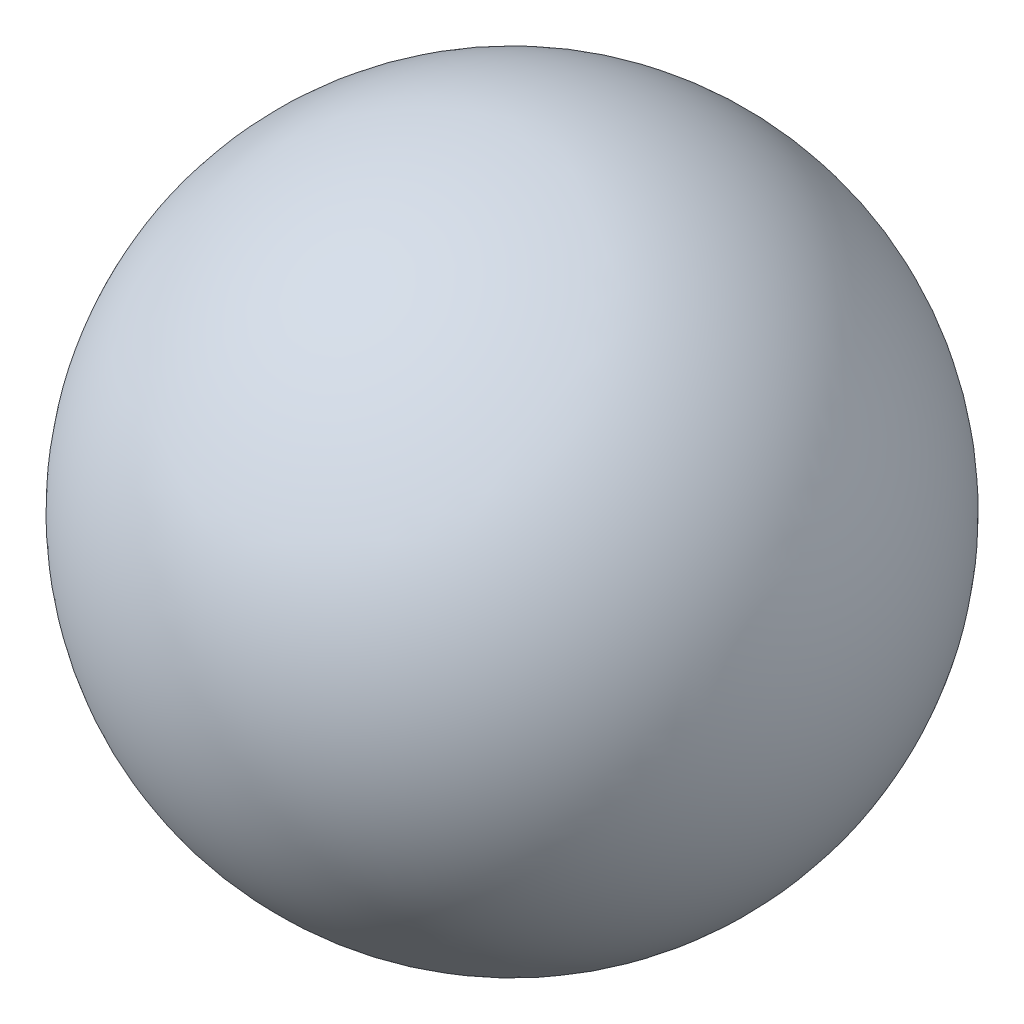
ISO-10303-21;
HEADER;
FILE_DESCRIPTION(('STEP AP214'),'2;1');
FILE_NAME('part.step','',(''),(''),'','','');
FILE_SCHEMA(('AUTOMOTIVE_DESIGN { 1 0 10303 214 1 1 1 1 }'));
ENDSEC;
DATA;
#1=APPLICATION_CONTEXT('core data for automotive mechanical design processes');
#2=APPLICATION_PROTOCOL_DEFINITION('international standard','automotive_design',2000,#1);
#3=PRODUCT_CONTEXT('',#1,'mechanical');
#4=PRODUCT('Part','Part','',(#3));
#5=PRODUCT_RELATED_PRODUCT_CATEGORY('part','',(#4));
#6=PRODUCT_DEFINITION_FORMATION('','',#4);
#7=PRODUCT_DEFINITION_CONTEXT('part definition',#1,'design');
#8=PRODUCT_DEFINITION('design','',#6,#7);
#9=PRODUCT_DEFINITION_SHAPE('','',#8);
#10=(LENGTH_UNIT() NAMED_UNIT(*) SI_UNIT(.MILLI.,.METRE.));
#11=(NAMED_UNIT(*) PLANE_ANGLE_UNIT() SI_UNIT($,.RADIAN.));
#12=(NAMED_UNIT(*) SI_UNIT($,.STERADIAN.) SOLID_ANGLE_UNIT());
#13=UNCERTAINTY_MEASURE_WITH_UNIT(LENGTH_MEASURE(1.E-05),#10,'distance_accuracy_value','');
#14=(GEOMETRIC_REPRESENTATION_CONTEXT(3) GLOBAL_UNCERTAINTY_ASSIGNED_CONTEXT((#13)) GLOBAL_UNIT_ASSIGNED_CONTEXT((#10,
#11,#12)) REPRESENTATION_CONTEXT('',''));
#15=CARTESIAN_POINT('',(0.,0.,0.));
#16=DIRECTION('',(0.,0.,1.));
#17=DIRECTION('',(1.,0.,0.));
#18=AXIS2_PLACEMENT_3D('',#15,#16,#17);
#19=CARTESIAN_POINT('',(7.,15.,0.));
#20=DIRECTION('',(1.,0.,0.));
#21=DIRECTION('',(0.,-1.,0.));
#22=AXIS2_PLACEMENT_3D('',#19,#20,#21);
#23=SPHERICAL_SURFACE('',#22,3.572);
#24=CARTESIAN_POINT('',(10.572,15.,0.));
#25=VERTEX_POINT('',#24);
#26=VERTEX_LOOP('',#25);
#27=FACE_BOUND('',#26,.T.);
#28=ADVANCED_FACE('F27',(#27),#23,.T.);
#29=CLOSED_SHELL('',(#28));
#30=MANIFOLD_SOLID_BREP('B2',#29);
#31=ADVANCED_BREP_SHAPE_REPRESENTATION('',(#18,#30),#14);
#32=SHAPE_DEFINITION_REPRESENTATION(#9,#31);
ENDSEC;
END-ISO-10303-21;
